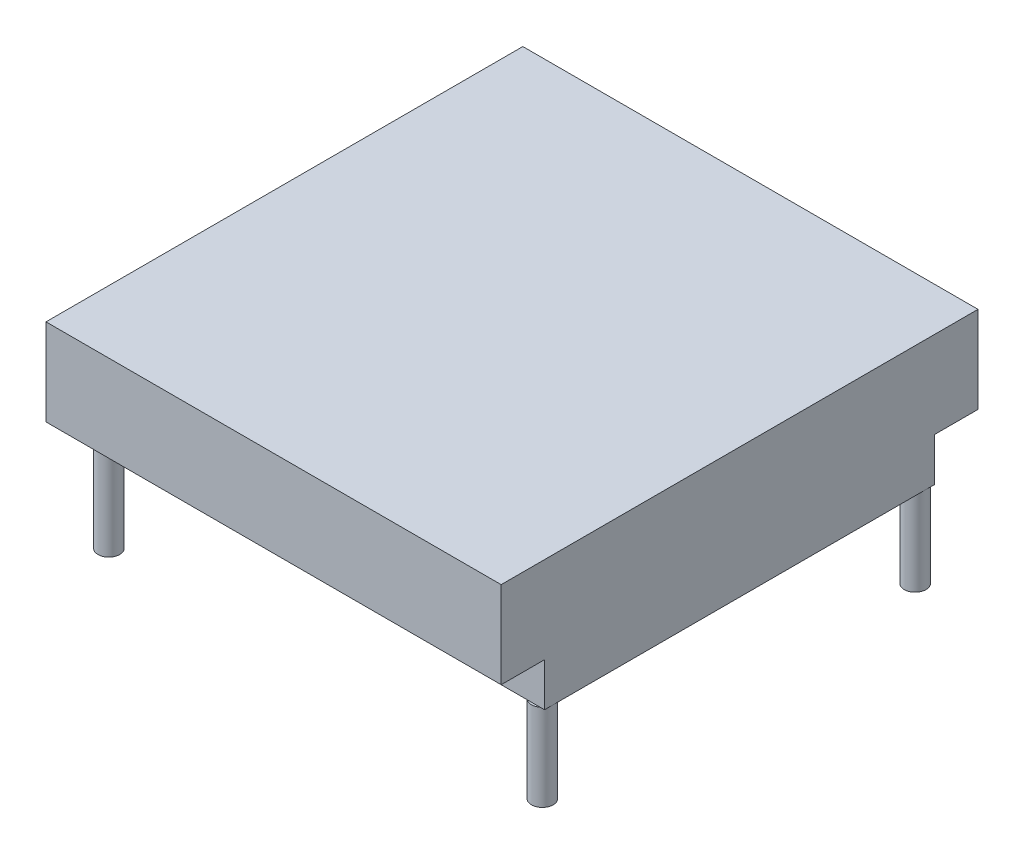
ISO-10303-21;
HEADER;
FILE_DESCRIPTION(('STEP AP214'),'2;1');
FILE_NAME('part.step','',(''),(''),'','','');
FILE_SCHEMA(('AUTOMOTIVE_DESIGN { 1 0 10303 214 1 1 1 1 }'));
ENDSEC;
DATA;
#1=APPLICATION_CONTEXT('core data for automotive mechanical design processes');
#2=APPLICATION_PROTOCOL_DEFINITION('international standard','automotive_design',2000,#1);
#3=PRODUCT_CONTEXT('',#1,'mechanical');
#4=PRODUCT('Part','Part','',(#3));
#5=PRODUCT_RELATED_PRODUCT_CATEGORY('part','',(#4));
#6=PRODUCT_DEFINITION_FORMATION('','',#4);
#7=PRODUCT_DEFINITION_CONTEXT('part definition',#1,'design');
#8=PRODUCT_DEFINITION('design','',#6,#7);
#9=PRODUCT_DEFINITION_SHAPE('','',#8);
#10=(LENGTH_UNIT() NAMED_UNIT(*) SI_UNIT(.MILLI.,.METRE.));
#11=(NAMED_UNIT(*) PLANE_ANGLE_UNIT() SI_UNIT($,.RADIAN.));
#12=(NAMED_UNIT(*) SI_UNIT($,.STERADIAN.) SOLID_ANGLE_UNIT());
#13=UNCERTAINTY_MEASURE_WITH_UNIT(LENGTH_MEASURE(1.E-05),#10,'distance_accuracy_value','');
#14=(GEOMETRIC_REPRESENTATION_CONTEXT(3) GLOBAL_UNCERTAINTY_ASSIGNED_CONTEXT((#13)) GLOBAL_UNIT_ASSIGNED_CONTEXT((#10,
#11,#12)) REPRESENTATION_CONTEXT('',''));
#15=CARTESIAN_POINT('',(0.,0.,0.));
#16=DIRECTION('',(0.,0.,1.));
#17=DIRECTION('',(1.,0.,0.));
#18=AXIS2_PLACEMENT_3D('',#15,#16,#17);
#19=CARTESIAN_POINT('',(0.,-12.7,0.));
#20=DIRECTION('',(0.,1.,0.));
#21=DIRECTION('',(0.,0.,1.));
#22=AXIS2_PLACEMENT_3D('',#19,#20,#21);
#23=PLANE('',#22);
#24=CARTESIAN_POINT('',(130.175,-12.7,12.5786717148401));
#25=DIRECTION('',(0.,-1.,0.));
#26=DIRECTION('',(0.,0.,-1.));
#27=AXIS2_PLACEMENT_3D('',#24,#25,#26);
#28=CIRCLE('',#27,3.175);
#29=CARTESIAN_POINT('',(128.27,-12.7,15.1186717148401));
#30=VERTEX_POINT('',#29);
#31=CARTESIAN_POINT('',(133.35,-12.7,12.5786717148401));
#32=VERTEX_POINT('',#31);
#33=EDGE_CURVE('E138',#30,#32,#28,.T.);
#34=ORIENTED_EDGE('',*,*,#33,.F.);
#35=DIRECTION('',(-1.,0.,0.));
#36=VECTOR('',#35,1.);
#37=CARTESIAN_POINT('',(133.35,-12.7,15.1186717148401));
#38=LINE('',#37,#36);
#39=CARTESIAN_POINT('',(82.55,-12.7,15.1186717148401));
#40=VERTEX_POINT('',#39);
#41=EDGE_CURVE('E125',#30,#40,#38,.T.);
#42=ORIENTED_EDGE('',*,*,#41,.T.);
#43=DIRECTION('',(0.,0.,-1.));
#44=VECTOR('',#43,1.);
#45=CARTESIAN_POINT('',(82.55,-12.7,15.1186717148401));
#46=LINE('',#45,#44);
#47=CARTESIAN_POINT('',(82.55,-12.7,-99.1813282851599));
#48=VERTEX_POINT('',#47);
#49=EDGE_CURVE('E172',#40,#48,#46,.T.);
#50=ORIENTED_EDGE('',*,*,#49,.T.);
#51=DIRECTION('',(1.,0.,0.));
#52=VECTOR('',#51,1.);
#53=CARTESIAN_POINT('',(133.35,-12.7,-99.1813282851599));
#54=LINE('',#53,#52);
#55=CARTESIAN_POINT('',(128.27,-12.7,-99.1813282851599));
#56=VERTEX_POINT('',#55);
#57=EDGE_CURVE('E175',#48,#56,#54,.T.);
#58=ORIENTED_EDGE('',*,*,#57,.T.);
#59=CARTESIAN_POINT('',(130.175,-12.7,-96.6413282851599));
#60=DIRECTION('',(0.,-1.,0.));
#61=DIRECTION('',(0.,0.,-1.));
#62=AXIS2_PLACEMENT_3D('',#59,#60,#61);
#63=CIRCLE('',#62,3.17499999999997);
#64=CARTESIAN_POINT('',(133.35,-12.7,-96.6413282851599));
#65=VERTEX_POINT('',#64);
#66=EDGE_CURVE('E11',#65,#56,#63,.T.);
#67=ORIENTED_EDGE('',*,*,#66,.F.);
#68=DIRECTION('',(0.,0.,1.));
#69=VECTOR('',#68,1.);
#70=CARTESIAN_POINT('',(133.35,-12.7,15.1186717148401));
#71=LINE('',#70,#69);
#72=EDGE_CURVE('E140',#65,#32,#71,.T.);
#73=ORIENTED_EDGE('',*,*,#72,.T.);
#74=EDGE_LOOP('',(#34,#42,#50,#58,#67,#73));
#75=FACE_BOUND('',#74,.T.);
#76=ADVANCED_FACE('F33',(#75),#23,.F.);
#77=CARTESIAN_POINT('',(132.08,-12.7,15.1186717148401));
#78=VERTEX_POINT('',#77);
#79=EDGE_CURVE('E52',#32,#78,#28,.T.);
#80=ORIENTED_EDGE('',*,*,#79,.F.);
#81=CARTESIAN_POINT('',(133.35,-12.7,15.1186717148401));
#82=VERTEX_POINT('',#81);
#83=EDGE_CURVE('E170',#32,#82,#71,.T.);
#84=ORIENTED_EDGE('',*,*,#83,.T.);
#85=EDGE_CURVE('E135',#82,#78,#38,.T.);
#86=ORIENTED_EDGE('',*,*,#85,.T.);
#87=EDGE_LOOP('',(#80,#84,#86));
#88=FACE_BOUND('',#87,.T.);
#89=ADVANCED_FACE('F274',(#88),#23,.F.);
#90=CARTESIAN_POINT('',(132.08,-12.7,-99.1813282851599));
#91=VERTEX_POINT('',#90);
#92=EDGE_CURVE('E44',#91,#65,#63,.T.);
#93=ORIENTED_EDGE('',*,*,#92,.F.);
#94=CARTESIAN_POINT('',(133.35,-12.7,-99.1813282851599));
#95=VERTEX_POINT('',#94);
#96=EDGE_CURVE('E174',#91,#95,#54,.T.);
#97=ORIENTED_EDGE('',*,*,#96,.T.);
#98=EDGE_CURVE('E133',#95,#65,#71,.T.);
#99=ORIENTED_EDGE('',*,*,#98,.T.);
#100=EDGE_LOOP('',(#93,#97,#99));
#101=FACE_BOUND('',#100,.T.);
#102=ADVANCED_FACE('F275',(#101),#23,.F.);
#103=CARTESIAN_POINT('',(0.,0.,0.));
#104=DIRECTION('',(0.,1.,0.));
#105=DIRECTION('',(0.,0.,1.));
#106=AXIS2_PLACEMENT_3D('',#103,#104,#105);
#107=PLANE('',#106);
#108=DIRECTION('',(0.,0.,1.));
#109=VECTOR('',#108,1.);
#110=CARTESIAN_POINT('',(0.,0.,-111.88132828516));
#111=LINE('',#110,#109);
#112=CARTESIAN_POINT('',(0.,0.,12.5786717148401));
#113=VERTEX_POINT('',#112);
#114=CARTESIAN_POINT('',(0.,0.,27.8186717148401));
#115=VERTEX_POINT('',#114);
#116=EDGE_CURVE('E203',#113,#115,#111,.T.);
#117=ORIENTED_EDGE('',*,*,#116,.F.);
#118=CARTESIAN_POINT('',(3.17499999999999,0.,12.5786717148401));
#119=DIRECTION('',(0.,-1.,0.));
#120=DIRECTION('',(0.,0.,-1.));
#121=AXIS2_PLACEMENT_3D('',#118,#119,#120);
#122=CIRCLE('',#121,3.175);
#123=EDGE_CURVE('E154',#113,#113,#122,.T.);
#124=ORIENTED_EDGE('',*,*,#123,.F.);
#125=CARTESIAN_POINT('',(0.,0.,-96.6413282851599));
#126=VERTEX_POINT('',#125);
#127=EDGE_CURVE('E219',#126,#113,#111,.T.);
#128=ORIENTED_EDGE('',*,*,#127,.F.);
#129=CARTESIAN_POINT('',(3.17499999999999,0.,-96.6413282851599));
#130=DIRECTION('',(0.,-1.,0.));
#131=DIRECTION('',(0.,0.,-1.));
#132=AXIS2_PLACEMENT_3D('',#129,#130,#131);
#133=CIRCLE('',#132,3.175);
#134=EDGE_CURVE('E160',#126,#126,#133,.T.);
#135=ORIENTED_EDGE('',*,*,#134,.F.);
#136=CARTESIAN_POINT('',(0.,0.,-111.88132828516));
#137=VERTEX_POINT('',#136);
#138=EDGE_CURVE('E216',#137,#126,#111,.T.);
#139=ORIENTED_EDGE('',*,*,#138,.F.);
#140=DIRECTION('',(-1.,0.,0.));
#141=VECTOR('',#140,1.);
#142=CARTESIAN_POINT('',(0.,0.,-111.88132828516));
#143=LINE('',#142,#141);
#144=CARTESIAN_POINT('',(133.35,0.,-111.88132828516));
#145=VERTEX_POINT('',#144);
#146=EDGE_CURVE('E209',#145,#137,#143,.T.);
#147=ORIENTED_EDGE('',*,*,#146,.F.);
#148=DIRECTION('',(0.,0.,-1.));
#149=VECTOR('',#148,1.);
#150=CARTESIAN_POINT('',(133.35,0.,-111.88132828516));
#151=LINE('',#150,#149);
#152=CARTESIAN_POINT('',(133.35,0.,-99.1813282851599));
#153=VERTEX_POINT('',#152);
#154=EDGE_CURVE('E221',#153,#145,#151,.T.);
#155=ORIENTED_EDGE('',*,*,#154,.F.);
#156=DIRECTION('',(1.,0.,0.));
#157=VECTOR('',#156,1.);
#158=CARTESIAN_POINT('',(133.35,0.,-99.1813282851599));
#159=LINE('',#158,#157);
#160=CARTESIAN_POINT('',(82.55,0.,-99.1813282851599));
#161=VERTEX_POINT('',#160);
#162=EDGE_CURVE('E182',#161,#153,#159,.T.);
#163=ORIENTED_EDGE('',*,*,#162,.F.);
#164=DIRECTION('',(0.,0.,-1.));
#165=VECTOR('',#164,1.);
#166=CARTESIAN_POINT('',(82.55,0.,15.1186717148401));
#167=LINE('',#166,#165);
#168=CARTESIAN_POINT('',(82.55,0.,15.1186717148401));
#169=VERTEX_POINT('',#168);
#170=EDGE_CURVE('E179',#169,#161,#167,.T.);
#171=ORIENTED_EDGE('',*,*,#170,.F.);
#172=DIRECTION('',(-1.,0.,0.));
#173=VECTOR('',#172,1.);
#174=CARTESIAN_POINT('',(133.35,0.,15.1186717148401));
#175=LINE('',#174,#173);
#176=CARTESIAN_POINT('',(133.35,0.,15.1186717148401));
#177=VERTEX_POINT('',#176);
#178=EDGE_CURVE('E166',#177,#169,#175,.T.);
#179=ORIENTED_EDGE('',*,*,#178,.F.);
#180=CARTESIAN_POINT('',(133.35,0.,27.8186717148401));
#181=VERTEX_POINT('',#180);
#182=EDGE_CURVE('E229',#181,#177,#151,.T.);
#183=ORIENTED_EDGE('',*,*,#182,.F.);
#184=DIRECTION('',(1.,0.,0.));
#185=VECTOR('',#184,1.);
#186=CARTESIAN_POINT('',(0.,0.,27.8186717148401));
#187=LINE('',#186,#185);
#188=EDGE_CURVE('E218',#115,#181,#187,.T.);
#189=ORIENTED_EDGE('',*,*,#188,.F.);
#190=EDGE_LOOP('',(#117,#124,#128,#135,#139,#147,#155,#163,#171,#179,#183,#189));
#191=FACE_BOUND('',#190,.T.);
#192=ADVANCED_FACE('F252',(#191),#107,.F.);
#193=CARTESIAN_POINT('',(0.,25.4,-111.88132828516));
#194=DIRECTION('',(1.,0.,0.));
#195=DIRECTION('',(0.,0.,-1.));
#196=AXIS2_PLACEMENT_3D('',#193,#194,#195);
#197=PLANE('',#196);
#198=ORIENTED_EDGE('',*,*,#138,.T.);
#199=ORIENTED_EDGE('',*,*,#127,.T.);
#200=ORIENTED_EDGE('',*,*,#116,.T.);
#201=DIRECTION('',(0.,-1.,0.));
#202=VECTOR('',#201,1.);
#203=CARTESIAN_POINT('',(0.,25.4,27.8186717148401));
#204=LINE('',#203,#202);
#205=CARTESIAN_POINT('',(0.,25.4,27.8186717148401));
#206=VERTEX_POINT('',#205);
#207=EDGE_CURVE('E42',#206,#115,#204,.T.);
#208=ORIENTED_EDGE('',*,*,#207,.F.);
#209=DIRECTION('',(0.,0.,1.));
#210=VECTOR('',#209,1.);
#211=CARTESIAN_POINT('',(0.,25.4,-111.88132828516));
#212=LINE('',#211,#210);
#213=CARTESIAN_POINT('',(0.,25.4,-111.88132828516));
#214=VERTEX_POINT('',#213);
#215=EDGE_CURVE('E205',#214,#206,#212,.T.);
#216=ORIENTED_EDGE('',*,*,#215,.F.);
#217=DIRECTION('',(0.,-1.,0.));
#218=VECTOR('',#217,1.);
#219=CARTESIAN_POINT('',(0.,25.4,-111.88132828516));
#220=LINE('',#219,#218);
#221=EDGE_CURVE('E215',#214,#137,#220,.T.);
#222=ORIENTED_EDGE('',*,*,#221,.T.);
#223=EDGE_LOOP('',(#198,#199,#200,#208,#216,#222));
#224=FACE_BOUND('',#223,.T.);
#225=ADVANCED_FACE('F35',(#224),#197,.F.);
#226=CARTESIAN_POINT('',(0.,25.4,27.8186717148401));
#227=DIRECTION('',(0.,0.,-1.));
#228=DIRECTION('',(-1.,0.,0.));
#229=AXIS2_PLACEMENT_3D('',#226,#227,#228);
#230=PLANE('',#229);
#231=ORIENTED_EDGE('',*,*,#188,.T.);
#232=DIRECTION('',(0.,-1.,0.));
#233=VECTOR('',#232,1.);
#234=CARTESIAN_POINT('',(133.35,25.4,27.8186717148401));
#235=LINE('',#234,#233);
#236=CARTESIAN_POINT('',(133.35,25.4,27.8186717148401));
#237=VERTEX_POINT('',#236);
#238=EDGE_CURVE('E234',#237,#181,#235,.T.);
#239=ORIENTED_EDGE('',*,*,#238,.F.);
#240=DIRECTION('',(1.,0.,0.));
#241=VECTOR('',#240,1.);
#242=CARTESIAN_POINT('',(0.,25.4,27.8186717148401));
#243=LINE('',#242,#241);
#244=EDGE_CURVE('E208',#206,#237,#243,.T.);
#245=ORIENTED_EDGE('',*,*,#244,.F.);
#246=ORIENTED_EDGE('',*,*,#207,.T.);
#247=EDGE_LOOP('',(#231,#239,#245,#246));
#248=FACE_BOUND('',#247,.T.);
#249=ADVANCED_FACE('F331',(#248),#230,.F.);
#250=CARTESIAN_POINT('',(133.35,25.4,-111.88132828516));
#251=DIRECTION('',(-1.,0.,0.));
#252=DIRECTION('',(0.,0.,1.));
#253=AXIS2_PLACEMENT_3D('',#250,#251,#252);
#254=PLANE('',#253);
#255=ORIENTED_EDGE('',*,*,#182,.T.);
#256=DIRECTION('',(0.,1.,0.));
#257=VECTOR('',#256,1.);
#258=CARTESIAN_POINT('',(133.35,-12.7,15.1186717148401));
#259=LINE('',#258,#257);
#260=EDGE_CURVE('E200',#82,#177,#259,.T.);
#261=ORIENTED_EDGE('',*,*,#260,.F.);
#262=ORIENTED_EDGE('',*,*,#83,.F.);
#263=ORIENTED_EDGE('',*,*,#72,.F.);
#264=ORIENTED_EDGE('',*,*,#98,.F.);
#265=DIRECTION('',(0.,1.,0.));
#266=VECTOR('',#265,1.);
#267=CARTESIAN_POINT('',(133.35,-12.7,-99.1813282851599));
#268=LINE('',#267,#266);
#269=EDGE_CURVE('E177',#95,#153,#268,.T.);
#270=ORIENTED_EDGE('',*,*,#269,.T.);
#271=ORIENTED_EDGE('',*,*,#154,.T.);
#272=DIRECTION('',(0.,-1.,0.));
#273=VECTOR('',#272,1.);
#274=CARTESIAN_POINT('',(133.35,25.4,-111.88132828516));
#275=LINE('',#274,#273);
#276=CARTESIAN_POINT('',(133.35,25.4,-111.88132828516));
#277=VERTEX_POINT('',#276);
#278=EDGE_CURVE('E237',#277,#145,#275,.T.);
#279=ORIENTED_EDGE('',*,*,#278,.F.);
#280=DIRECTION('',(0.,0.,-1.));
#281=VECTOR('',#280,1.);
#282=CARTESIAN_POINT('',(133.35,25.4,-111.88132828516));
#283=LINE('',#282,#281);
#284=EDGE_CURVE('E211',#237,#277,#283,.T.);
#285=ORIENTED_EDGE('',*,*,#284,.F.);
#286=ORIENTED_EDGE('',*,*,#238,.T.);
#287=EDGE_LOOP('',(#255,#261,#262,#263,#264,#270,#271,#279,#285,#286));
#288=FACE_BOUND('',#287,.T.);
#289=ADVANCED_FACE('F338',(#288),#254,.F.);
#290=CARTESIAN_POINT('',(0.,25.4,-111.88132828516));
#291=DIRECTION('',(0.,0.,1.));
#292=DIRECTION('',(1.,0.,0.));
#293=AXIS2_PLACEMENT_3D('',#290,#291,#292);
#294=PLANE('',#293);
#295=ORIENTED_EDGE('',*,*,#146,.T.);
#296=ORIENTED_EDGE('',*,*,#221,.F.);
#297=DIRECTION('',(-1.,0.,0.));
#298=VECTOR('',#297,1.);
#299=CARTESIAN_POINT('',(0.,25.4,-111.88132828516));
#300=LINE('',#299,#298);
#301=EDGE_CURVE('E213',#277,#214,#300,.T.);
#302=ORIENTED_EDGE('',*,*,#301,.F.);
#303=ORIENTED_EDGE('',*,*,#278,.T.);
#304=EDGE_LOOP('',(#295,#296,#302,#303));
#305=FACE_BOUND('',#304,.T.);
#306=ADVANCED_FACE('F337',(#305),#294,.F.);
#307=CARTESIAN_POINT('',(0.,25.4,0.));
#308=DIRECTION('',(0.,1.,0.));
#309=DIRECTION('',(0.,0.,1.));
#310=AXIS2_PLACEMENT_3D('',#307,#308,#309);
#311=PLANE('',#310);
#312=ORIENTED_EDGE('',*,*,#215,.T.);
#313=ORIENTED_EDGE('',*,*,#244,.T.);
#314=ORIENTED_EDGE('',*,*,#284,.T.);
#315=ORIENTED_EDGE('',*,*,#301,.T.);
#316=EDGE_LOOP('',(#312,#313,#314,#315));
#317=FACE_BOUND('',#316,.T.);
#318=ADVANCED_FACE('F335',(#317),#311,.T.);
#319=CARTESIAN_POINT('',(133.35,-12.7,15.1186717148401));
#320=DIRECTION('',(0.,0.,-1.));
#321=DIRECTION('',(-1.,0.,0.));
#322=AXIS2_PLACEMENT_3D('',#319,#320,#321);
#323=PLANE('',#322);
#324=ORIENTED_EDGE('',*,*,#178,.T.);
#325=DIRECTION('',(0.,1.,0.));
#326=VECTOR('',#325,1.);
#327=CARTESIAN_POINT('',(82.55,-12.7,15.1186717148401));
#328=LINE('',#327,#326);
#329=EDGE_CURVE('E130',#40,#169,#328,.T.);
#330=ORIENTED_EDGE('',*,*,#329,.F.);
#331=ORIENTED_EDGE('',*,*,#41,.F.);
#332=EDGE_CURVE('E60',#78,#30,#38,.T.);
#333=ORIENTED_EDGE('',*,*,#332,.F.);
#334=ORIENTED_EDGE('',*,*,#85,.F.);
#335=ORIENTED_EDGE('',*,*,#260,.T.);
#336=EDGE_LOOP('',(#324,#330,#331,#333,#334,#335));
#337=FACE_BOUND('',#336,.T.);
#338=ADVANCED_FACE('F128',(#337),#323,.F.);
#339=CARTESIAN_POINT('',(82.55,-12.7,15.1186717148401));
#340=DIRECTION('',(1.,0.,0.));
#341=DIRECTION('',(0.,0.,-1.));
#342=AXIS2_PLACEMENT_3D('',#339,#340,#341);
#343=PLANE('',#342);
#344=ORIENTED_EDGE('',*,*,#170,.T.);
#345=DIRECTION('',(0.,1.,0.));
#346=VECTOR('',#345,1.);
#347=CARTESIAN_POINT('',(82.55,-12.7,-99.1813282851599));
#348=LINE('',#347,#346);
#349=EDGE_CURVE('E185',#48,#161,#348,.T.);
#350=ORIENTED_EDGE('',*,*,#349,.F.);
#351=ORIENTED_EDGE('',*,*,#49,.F.);
#352=ORIENTED_EDGE('',*,*,#329,.T.);
#353=EDGE_LOOP('',(#344,#350,#351,#352));
#354=FACE_BOUND('',#353,.T.);
#355=ADVANCED_FACE('F269',(#354),#343,.F.);
#356=CARTESIAN_POINT('',(133.35,-12.7,-99.1813282851599));
#357=DIRECTION('',(0.,0.,1.));
#358=DIRECTION('',(1.,0.,0.));
#359=AXIS2_PLACEMENT_3D('',#356,#357,#358);
#360=PLANE('',#359);
#361=ORIENTED_EDGE('',*,*,#162,.T.);
#362=ORIENTED_EDGE('',*,*,#269,.F.);
#363=ORIENTED_EDGE('',*,*,#96,.F.);
#364=EDGE_CURVE('E178',#56,#91,#54,.T.);
#365=ORIENTED_EDGE('',*,*,#364,.F.);
#366=ORIENTED_EDGE('',*,*,#57,.F.);
#367=ORIENTED_EDGE('',*,*,#349,.T.);
#368=EDGE_LOOP('',(#361,#362,#363,#365,#366,#367));
#369=FACE_BOUND('',#368,.T.);
#370=ADVANCED_FACE('F258',(#369),#360,.F.);
#371=CARTESIAN_POINT('',(3.17499999999999,-38.1,-96.6413282851599));
#372=DIRECTION('',(0.,1.,0.));
#373=DIRECTION('',(0.,0.,1.));
#374=AXIS2_PLACEMENT_3D('',#371,#372,#373);
#375=CYLINDRICAL_SURFACE('',#374,3.175);
#376=CARTESIAN_POINT('',(3.17499999999999,-38.1,-96.6413282851599));
#377=DIRECTION('',(0.,-1.,0.));
#378=DIRECTION('',(0.,0.,-1.));
#379=AXIS2_PLACEMENT_3D('',#376,#377,#378);
#380=CIRCLE('',#379,3.175);
#381=CARTESIAN_POINT('',(3.17499999999999,-38.1,-99.8163282851599));
#382=VERTEX_POINT('',#381);
#383=EDGE_CURVE('E163',#382,#382,#380,.T.);
#384=ORIENTED_EDGE('',*,*,#383,.F.);
#385=EDGE_LOOP('',(#384));
#386=FACE_BOUND('',#385,.T.);
#387=ORIENTED_EDGE('',*,*,#134,.T.);
#388=EDGE_LOOP('',(#387));
#389=FACE_BOUND('',#388,.T.);
#390=ADVANCED_FACE('F255',(#386,#389),#375,.T.);
#391=CARTESIAN_POINT('',(3.17499999999999,-38.1,-96.6413282851599));
#392=DIRECTION('',(0.,-1.,0.));
#393=DIRECTION('',(0.,0.,-1.));
#394=AXIS2_PLACEMENT_3D('',#391,#392,#393);
#395=PLANE('',#394);
#396=ORIENTED_EDGE('',*,*,#383,.T.);
#397=EDGE_LOOP('',(#396));
#398=FACE_BOUND('',#397,.T.);
#399=ADVANCED_FACE('F257',(#398),#395,.T.);
#400=CARTESIAN_POINT('',(3.17499999999999,-38.1,12.5786717148401));
#401=DIRECTION('',(0.,1.,0.));
#402=DIRECTION('',(0.,0.,1.));
#403=AXIS2_PLACEMENT_3D('',#400,#401,#402);
#404=CYLINDRICAL_SURFACE('',#403,3.175);
#405=CARTESIAN_POINT('',(3.17499999999999,-38.1,12.5786717148401));
#406=DIRECTION('',(0.,-1.,0.));
#407=DIRECTION('',(0.,0.,-1.));
#408=AXIS2_PLACEMENT_3D('',#405,#406,#407);
#409=CIRCLE('',#408,3.175);
#410=CARTESIAN_POINT('',(3.17499999999999,-38.1,9.40367171484009));
#411=VERTEX_POINT('',#410);
#412=EDGE_CURVE('E157',#411,#411,#409,.T.);
#413=ORIENTED_EDGE('',*,*,#412,.F.);
#414=EDGE_LOOP('',(#413));
#415=FACE_BOUND('',#414,.T.);
#416=ORIENTED_EDGE('',*,*,#123,.T.);
#417=EDGE_LOOP('',(#416));
#418=FACE_BOUND('',#417,.T.);
#419=ADVANCED_FACE('F265',(#415,#418),#404,.T.);
#420=CARTESIAN_POINT('',(3.17499999999999,-38.1,12.5786717148401));
#421=DIRECTION('',(0.,-1.,0.));
#422=DIRECTION('',(0.,0.,-1.));
#423=AXIS2_PLACEMENT_3D('',#420,#421,#422);
#424=PLANE('',#423);
#425=ORIENTED_EDGE('',*,*,#412,.T.);
#426=EDGE_LOOP('',(#425));
#427=FACE_BOUND('',#426,.T.);
#428=ADVANCED_FACE('F315',(#427),#424,.T.);
#429=CARTESIAN_POINT('',(130.175,-12.7,-96.6413282851599));
#430=DIRECTION('',(0.,-1.,0.));
#431=DIRECTION('',(0.,0.,-1.));
#432=AXIS2_PLACEMENT_3D('',#429,#430,#431);
#433=PLANE('',#432);
#434=EDGE_CURVE('E45',#56,#91,#63,.T.);
#435=ORIENTED_EDGE('',*,*,#434,.F.);
#436=ORIENTED_EDGE('',*,*,#364,.T.);
#437=EDGE_LOOP('',(#435,#436));
#438=FACE_BOUND('',#437,.T.);
#439=ADVANCED_FACE('F293',(#438),#433,.F.);
#440=CARTESIAN_POINT('',(130.175,-38.1,-96.6413282851599));
#441=DIRECTION('',(0.,1.,0.));
#442=DIRECTION('',(0.,0.,1.));
#443=AXIS2_PLACEMENT_3D('',#440,#441,#442);
#444=CYLINDRICAL_SURFACE('',#443,3.17499999999997);
#445=CARTESIAN_POINT('',(130.175,-38.1,-96.6413282851599));
#446=DIRECTION('',(0.,-1.,0.));
#447=DIRECTION('',(0.,0.,-1.));
#448=AXIS2_PLACEMENT_3D('',#445,#446,#447);
#449=CIRCLE('',#448,3.17499999999997);
#450=CARTESIAN_POINT('',(130.175,-38.1,-99.8163282851599));
#451=VERTEX_POINT('',#450);
#452=EDGE_CURVE('E152',#451,#451,#449,.T.);
#453=ORIENTED_EDGE('',*,*,#452,.F.);
#454=EDGE_LOOP('',(#453));
#455=FACE_BOUND('',#454,.T.);
#456=ORIENTED_EDGE('',*,*,#92,.T.);
#457=ORIENTED_EDGE('',*,*,#66,.T.);
#458=ORIENTED_EDGE('',*,*,#434,.T.);
#459=EDGE_LOOP('',(#456,#457,#458));
#460=FACE_BOUND('',#459,.T.);
#461=ADVANCED_FACE('F294',(#455,#460),#444,.T.);
#462=CARTESIAN_POINT('',(130.175,-38.1,-96.6413282851599));
#463=DIRECTION('',(0.,-1.,0.));
#464=DIRECTION('',(0.,0.,-1.));
#465=AXIS2_PLACEMENT_3D('',#462,#463,#464);
#466=PLANE('',#465);
#467=ORIENTED_EDGE('',*,*,#452,.T.);
#468=EDGE_LOOP('',(#467));
#469=FACE_BOUND('',#468,.T.);
#470=ADVANCED_FACE('F307',(#469),#466,.T.);
#471=CARTESIAN_POINT('',(130.175,-12.7,12.5786717148401));
#472=DIRECTION('',(0.,-1.,0.));
#473=DIRECTION('',(0.,0.,-1.));
#474=AXIS2_PLACEMENT_3D('',#471,#472,#473);
#475=PLANE('',#474);
#476=EDGE_CURVE('E143',#78,#30,#28,.T.);
#477=ORIENTED_EDGE('',*,*,#476,.F.);
#478=ORIENTED_EDGE('',*,*,#332,.T.);
#479=EDGE_LOOP('',(#477,#478));
#480=FACE_BOUND('',#479,.T.);
#481=ADVANCED_FACE('F147',(#480),#475,.F.);
#482=CARTESIAN_POINT('',(130.175,-38.1,12.5786717148401));
#483=DIRECTION('',(0.,1.,0.));
#484=DIRECTION('',(0.,0.,1.));
#485=AXIS2_PLACEMENT_3D('',#482,#483,#484);
#486=CYLINDRICAL_SURFACE('',#485,3.175);
#487=CARTESIAN_POINT('',(130.175,-38.1,12.5786717148401));
#488=DIRECTION('',(0.,-1.,0.));
#489=DIRECTION('',(0.,0.,-1.));
#490=AXIS2_PLACEMENT_3D('',#487,#488,#489);
#491=CIRCLE('',#490,3.175);
#492=CARTESIAN_POINT('',(130.175,-38.1,9.40367171484009));
#493=VERTEX_POINT('',#492);
#494=EDGE_CURVE('E149',#493,#493,#491,.T.);
#495=ORIENTED_EDGE('',*,*,#494,.F.);
#496=EDGE_LOOP('',(#495));
#497=FACE_BOUND('',#496,.T.);
#498=ORIENTED_EDGE('',*,*,#79,.T.);
#499=ORIENTED_EDGE('',*,*,#476,.T.);
#500=ORIENTED_EDGE('',*,*,#33,.T.);
#501=EDGE_LOOP('',(#498,#499,#500));
#502=FACE_BOUND('',#501,.T.);
#503=ADVANCED_FACE('F148',(#497,#502),#486,.T.);
#504=CARTESIAN_POINT('',(130.175,-38.1,12.5786717148401));
#505=DIRECTION('',(0.,-1.,0.));
#506=DIRECTION('',(0.,0.,-1.));
#507=AXIS2_PLACEMENT_3D('',#504,#505,#506);
#508=PLANE('',#507);
#509=ORIENTED_EDGE('',*,*,#494,.T.);
#510=EDGE_LOOP('',(#509));
#511=FACE_BOUND('',#510,.T.);
#512=ADVANCED_FACE('F298',(#511),#508,.T.);
#513=CLOSED_SHELL('',(#76,#89,#102,#192,#225,#249,#289,#306,#318,#338,#355,#370,#390,#399,#419,
#428,#439,#461,#470,#481,#503,#512));
#514=MANIFOLD_SOLID_BREP('B2',#513);
#515=ADVANCED_BREP_SHAPE_REPRESENTATION('',(#18,#514),#14);
#516=SHAPE_DEFINITION_REPRESENTATION(#9,#515);
ENDSEC;
END-ISO-10303-21;
